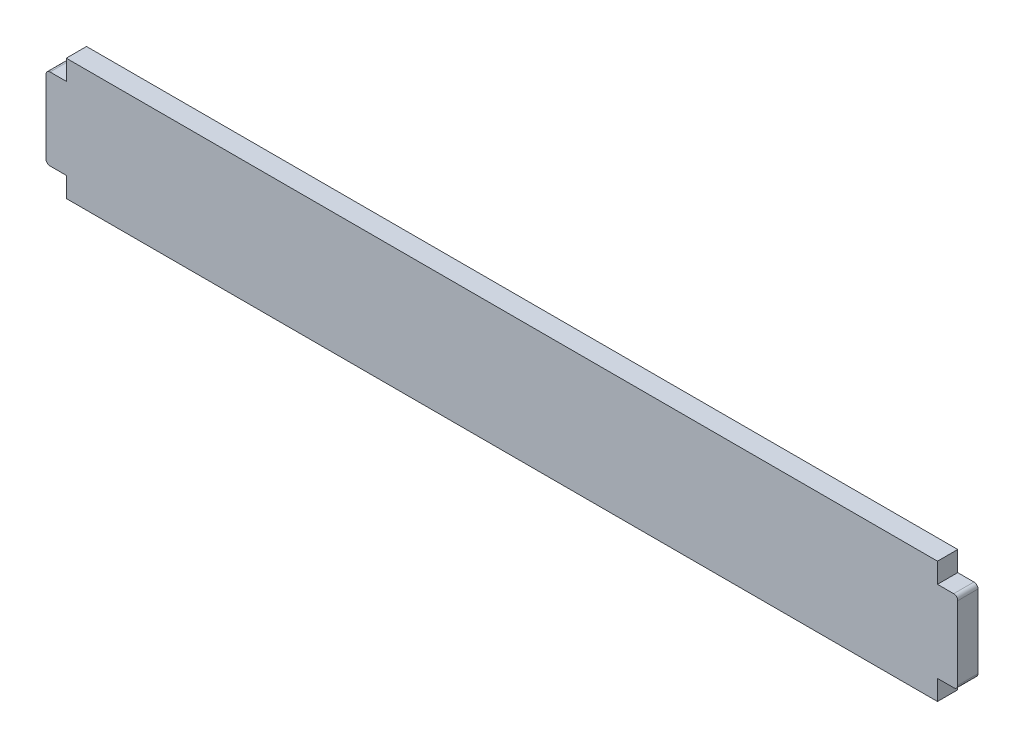
ISO-10303-21;
HEADER;
FILE_DESCRIPTION(('STEP AP214'),'2;1');
FILE_NAME('part.step','',(''),(''),'','','');
FILE_SCHEMA(('AUTOMOTIVE_DESIGN { 1 0 10303 214 1 1 1 1 }'));
ENDSEC;
DATA;
#1=APPLICATION_CONTEXT('core data for automotive mechanical design processes');
#2=APPLICATION_PROTOCOL_DEFINITION('international standard','automotive_design',2000,#1);
#3=PRODUCT_CONTEXT('',#1,'mechanical');
#4=PRODUCT('Part','Part','',(#3));
#5=PRODUCT_RELATED_PRODUCT_CATEGORY('part','',(#4));
#6=PRODUCT_DEFINITION_FORMATION('','',#4);
#7=PRODUCT_DEFINITION_CONTEXT('part definition',#1,'design');
#8=PRODUCT_DEFINITION('design','',#6,#7);
#9=PRODUCT_DEFINITION_SHAPE('','',#8);
#10=(LENGTH_UNIT() NAMED_UNIT(*) SI_UNIT(.MILLI.,.METRE.));
#11=(NAMED_UNIT(*) PLANE_ANGLE_UNIT() SI_UNIT($,.RADIAN.));
#12=(NAMED_UNIT(*) SI_UNIT($,.STERADIAN.) SOLID_ANGLE_UNIT());
#13=UNCERTAINTY_MEASURE_WITH_UNIT(LENGTH_MEASURE(1.E-05),#10,'distance_accuracy_value','');
#14=(GEOMETRIC_REPRESENTATION_CONTEXT(3) GLOBAL_UNCERTAINTY_ASSIGNED_CONTEXT((#13)) GLOBAL_UNIT_ASSIGNED_CONTEXT((#10,
#11,#12)) REPRESENTATION_CONTEXT('',''));
#15=CARTESIAN_POINT('',(0.,0.,0.));
#16=DIRECTION('',(0.,0.,1.));
#17=DIRECTION('',(1.,0.,0.));
#18=AXIS2_PLACEMENT_3D('',#15,#16,#17);
#19=CARTESIAN_POINT('',(4.99999999999999,30.05,5.));
#20=DIRECTION('',(1.,0.,0.));
#21=DIRECTION('',(0.,1.,0.));
#22=AXIS2_PLACEMENT_3D('',#19,#20,#21);
#23=PLANE('',#22);
#24=DIRECTION('',(0.,-1.,0.));
#25=VECTOR('',#24,1.);
#26=CARTESIAN_POINT('',(4.99999999999999,30.05,0.));
#27=LINE('',#26,#25);
#28=CARTESIAN_POINT('',(4.99999999999999,30.05,0.));
#29=VERTEX_POINT('',#28);
#30=CARTESIAN_POINT('',(5.,25.1,0.));
#31=VERTEX_POINT('',#30);
#32=EDGE_CURVE('E176',#29,#31,#27,.T.);
#33=ORIENTED_EDGE('',*,*,#32,.T.);
#34=DIRECTION('',(0.,0.,-1.));
#35=VECTOR('',#34,1.);
#36=CARTESIAN_POINT('',(5.,25.1,5.));
#37=LINE('',#36,#35);
#38=CARTESIAN_POINT('',(5.,25.1,5.));
#39=VERTEX_POINT('',#38);
#40=EDGE_CURVE('E158',#39,#31,#37,.T.);
#41=ORIENTED_EDGE('',*,*,#40,.F.);
#42=DIRECTION('',(0.,-1.,0.));
#43=VECTOR('',#42,1.);
#44=CARTESIAN_POINT('',(4.99999999999999,30.05,5.));
#45=LINE('',#44,#43);
#46=CARTESIAN_POINT('',(4.99999999999999,30.05,5.));
#47=VERTEX_POINT('',#46);
#48=EDGE_CURVE('E163',#47,#39,#45,.T.);
#49=ORIENTED_EDGE('',*,*,#48,.F.);
#50=DIRECTION('',(0.,0.,-1.));
#51=VECTOR('',#50,1.);
#52=CARTESIAN_POINT('',(4.99999999999999,30.05,5.));
#53=LINE('',#52,#51);
#54=EDGE_CURVE('E258',#47,#29,#53,.T.);
#55=ORIENTED_EDGE('',*,*,#54,.T.);
#56=EDGE_LOOP('',(#33,#41,#49,#55));
#57=FACE_BOUND('',#56,.T.);
#58=ADVANCED_FACE('F40',(#57),#23,.F.);
#59=CARTESIAN_POINT('',(0.,25.1,5.));
#60=DIRECTION('',(0.,-1.,0.));
#61=DIRECTION('',(0.,0.,-1.));
#62=AXIS2_PLACEMENT_3D('',#59,#60,#61);
#63=PLANE('',#62);
#64=DIRECTION('',(-1.,0.,0.));
#65=VECTOR('',#64,1.);
#66=CARTESIAN_POINT('',(0.,25.1,0.));
#67=LINE('',#66,#65);
#68=CARTESIAN_POINT('',(0.999999999999994,25.1,0.));
#69=VERTEX_POINT('',#68);
#70=EDGE_CURVE('E240',#31,#69,#67,.T.);
#71=ORIENTED_EDGE('',*,*,#70,.T.);
#72=DIRECTION('',(0.,0.,-1.));
#73=VECTOR('',#72,1.);
#74=CARTESIAN_POINT('',(0.999999999999994,25.1,5.));
#75=LINE('',#74,#73);
#76=CARTESIAN_POINT('',(0.999999999999994,25.1,5.));
#77=VERTEX_POINT('',#76);
#78=EDGE_CURVE('E11',#69,#77,#75,.F.);
#79=ORIENTED_EDGE('',*,*,#78,.T.);
#80=DIRECTION('',(-1.,0.,0.));
#81=VECTOR('',#80,1.);
#82=CARTESIAN_POINT('',(0.,25.1,5.));
#83=LINE('',#82,#81);
#84=EDGE_CURVE('E153',#39,#77,#83,.T.);
#85=ORIENTED_EDGE('',*,*,#84,.F.);
#86=ORIENTED_EDGE('',*,*,#40,.T.);
#87=EDGE_LOOP('',(#71,#79,#85,#86));
#88=FACE_BOUND('',#87,.T.);
#89=ADVANCED_FACE('F156',(#88),#63,.F.);
#90=CARTESIAN_POINT('',(0.,5.,5.));
#91=DIRECTION('',(1.,0.,0.));
#92=DIRECTION('',(0.,1.,0.));
#93=AXIS2_PLACEMENT_3D('',#90,#91,#92);
#94=PLANE('',#93);
#95=DIRECTION('',(0.,-1.,0.));
#96=VECTOR('',#95,1.);
#97=CARTESIAN_POINT('',(0.,5.,0.));
#98=LINE('',#97,#96);
#99=CARTESIAN_POINT('',(0.,24.1,0.));
#100=VERTEX_POINT('',#99);
#101=CARTESIAN_POINT('',(0.,6.,0.));
#102=VERTEX_POINT('',#101);
#103=EDGE_CURVE('E220',#100,#102,#98,.T.);
#104=ORIENTED_EDGE('',*,*,#103,.T.);
#105=DIRECTION('',(0.,0.,-1.));
#106=VECTOR('',#105,1.);
#107=CARTESIAN_POINT('',(0.,6.,5.));
#108=LINE('',#107,#106);
#109=CARTESIAN_POINT('',(0.,6.,5.));
#110=VERTEX_POINT('',#109);
#111=EDGE_CURVE('E48',#102,#110,#108,.F.);
#112=ORIENTED_EDGE('',*,*,#111,.T.);
#113=DIRECTION('',(0.,-1.,0.));
#114=VECTOR('',#113,1.);
#115=CARTESIAN_POINT('',(0.,5.,5.));
#116=LINE('',#115,#114);
#117=CARTESIAN_POINT('',(0.,24.1,5.));
#118=VERTEX_POINT('',#117);
#119=EDGE_CURVE('E162',#118,#110,#116,.T.);
#120=ORIENTED_EDGE('',*,*,#119,.F.);
#121=DIRECTION('',(0.,0.,-1.));
#122=VECTOR('',#121,1.);
#123=CARTESIAN_POINT('',(0.,24.1,5.));
#124=LINE('',#123,#122);
#125=EDGE_CURVE('E211',#118,#100,#124,.T.);
#126=ORIENTED_EDGE('',*,*,#125,.T.);
#127=EDGE_LOOP('',(#104,#112,#120,#126));
#128=FACE_BOUND('',#127,.T.);
#129=ADVANCED_FACE('F217',(#128),#94,.F.);
#130=CARTESIAN_POINT('',(0.,5.,5.));
#131=DIRECTION('',(0.,1.,0.));
#132=DIRECTION('',(0.,0.,1.));
#133=AXIS2_PLACEMENT_3D('',#130,#131,#132);
#134=PLANE('',#133);
#135=DIRECTION('',(1.,0.,0.));
#136=VECTOR('',#135,1.);
#137=CARTESIAN_POINT('',(0.,5.,5.));
#138=LINE('',#137,#136);
#139=CARTESIAN_POINT('',(1.,5.,5.));
#140=VERTEX_POINT('',#139);
#141=CARTESIAN_POINT('',(5.,5.,5.));
#142=VERTEX_POINT('',#141);
#143=EDGE_CURVE('E222',#140,#142,#138,.T.);
#144=ORIENTED_EDGE('',*,*,#143,.F.);
#145=DIRECTION('',(0.,0.,-1.));
#146=VECTOR('',#145,1.);
#147=CARTESIAN_POINT('',(1.,5.,5.));
#148=LINE('',#147,#146);
#149=CARTESIAN_POINT('',(1.,5.,0.));
#150=VERTEX_POINT('',#149);
#151=EDGE_CURVE('E208',#140,#150,#148,.T.);
#152=ORIENTED_EDGE('',*,*,#151,.T.);
#153=DIRECTION('',(1.,0.,0.));
#154=VECTOR('',#153,1.);
#155=CARTESIAN_POINT('',(0.,5.,0.));
#156=LINE('',#155,#154);
#157=CARTESIAN_POINT('',(5.,5.,0.));
#158=VERTEX_POINT('',#157);
#159=EDGE_CURVE('E230',#150,#158,#156,.T.);
#160=ORIENTED_EDGE('',*,*,#159,.T.);
#161=DIRECTION('',(0.,0.,-1.));
#162=VECTOR('',#161,1.);
#163=CARTESIAN_POINT('',(5.,5.,5.));
#164=LINE('',#163,#162);
#165=EDGE_CURVE('E178',#142,#158,#164,.T.);
#166=ORIENTED_EDGE('',*,*,#165,.F.);
#167=EDGE_LOOP('',(#144,#152,#160,#166));
#168=FACE_BOUND('',#167,.T.);
#169=ADVANCED_FACE('F228',(#168),#134,.F.);
#170=CARTESIAN_POINT('',(5.,0.0499999999999997,5.));
#171=DIRECTION('',(1.,0.,0.));
#172=DIRECTION('',(0.,1.,0.));
#173=AXIS2_PLACEMENT_3D('',#170,#171,#172);
#174=PLANE('',#173);
#175=DIRECTION('',(0.,-1.,0.));
#176=VECTOR('',#175,1.);
#177=CARTESIAN_POINT('',(5.,0.0499999999999997,0.));
#178=LINE('',#177,#176);
#179=CARTESIAN_POINT('',(5.,0.0499999999999997,0.));
#180=VERTEX_POINT('',#179);
#181=EDGE_CURVE('E236',#158,#180,#178,.T.);
#182=ORIENTED_EDGE('',*,*,#181,.T.);
#183=DIRECTION('',(0.,0.,-1.));
#184=VECTOR('',#183,1.);
#185=CARTESIAN_POINT('',(5.,0.0499999999999997,5.));
#186=LINE('',#185,#184);
#187=CARTESIAN_POINT('',(5.,0.0499999999999997,5.));
#188=VERTEX_POINT('',#187);
#189=EDGE_CURVE('E183',#188,#180,#186,.T.);
#190=ORIENTED_EDGE('',*,*,#189,.F.);
#191=DIRECTION('',(0.,-1.,0.));
#192=VECTOR('',#191,1.);
#193=CARTESIAN_POINT('',(5.,0.0499999999999997,5.));
#194=LINE('',#193,#192);
#195=EDGE_CURVE('E486',#142,#188,#194,.T.);
#196=ORIENTED_EDGE('',*,*,#195,.F.);
#197=ORIENTED_EDGE('',*,*,#165,.T.);
#198=EDGE_LOOP('',(#182,#190,#196,#197));
#199=FACE_BOUND('',#198,.T.);
#200=ADVANCED_FACE('F362',(#199),#174,.F.);
#201=CARTESIAN_POINT('',(5.,0.0499999999999997,5.));
#202=DIRECTION('',(0.,1.,0.));
#203=DIRECTION('',(-1.,0.,0.));
#204=AXIS2_PLACEMENT_3D('',#201,#202,#203);
#205=PLANE('',#204);
#206=DIRECTION('',(1.,0.,0.));
#207=VECTOR('',#206,1.);
#208=CARTESIAN_POINT('',(5.,0.0499999999999997,0.));
#209=LINE('',#208,#207);
#210=CARTESIAN_POINT('',(220.,0.0500000000000129,0.));
#211=VERTEX_POINT('',#210);
#212=EDGE_CURVE('E238',#180,#211,#209,.T.);
#213=ORIENTED_EDGE('',*,*,#212,.T.);
#214=DIRECTION('',(0.,0.,-1.));
#215=VECTOR('',#214,1.);
#216=CARTESIAN_POINT('',(220.,0.0500000000000129,5.));
#217=LINE('',#216,#215);
#218=CARTESIAN_POINT('',(220.,0.0500000000000129,5.));
#219=VERTEX_POINT('',#218);
#220=EDGE_CURVE('E269',#219,#211,#217,.T.);
#221=ORIENTED_EDGE('',*,*,#220,.F.);
#222=DIRECTION('',(1.,0.,0.));
#223=VECTOR('',#222,1.);
#224=CARTESIAN_POINT('',(5.,0.0499999999999997,5.));
#225=LINE('',#224,#223);
#226=EDGE_CURVE('E277',#188,#219,#225,.T.);
#227=ORIENTED_EDGE('',*,*,#226,.F.);
#228=ORIENTED_EDGE('',*,*,#189,.T.);
#229=EDGE_LOOP('',(#213,#221,#227,#228));
#230=FACE_BOUND('',#229,.T.);
#231=ADVANCED_FACE('F275',(#230),#205,.F.);
#232=CARTESIAN_POINT('',(220.,0.0500000000000129,5.));
#233=DIRECTION('',(-1.,0.,0.));
#234=DIRECTION('',(0.,0.,1.));
#235=AXIS2_PLACEMENT_3D('',#232,#233,#234);
#236=PLANE('',#235);
#237=DIRECTION('',(0.,1.,0.));
#238=VECTOR('',#237,1.);
#239=CARTESIAN_POINT('',(220.,0.0500000000000129,0.));
#240=LINE('',#239,#238);
#241=CARTESIAN_POINT('',(220.,5.00000000000001,0.));
#242=VERTEX_POINT('',#241);
#243=EDGE_CURVE('E245',#211,#242,#240,.T.);
#244=ORIENTED_EDGE('',*,*,#243,.T.);
#245=DIRECTION('',(0.,0.,-1.));
#246=VECTOR('',#245,1.);
#247=CARTESIAN_POINT('',(220.,5.00000000000001,5.));
#248=LINE('',#247,#246);
#249=CARTESIAN_POINT('',(220.,5.00000000000001,5.));
#250=VERTEX_POINT('',#249);
#251=EDGE_CURVE('E266',#250,#242,#248,.T.);
#252=ORIENTED_EDGE('',*,*,#251,.F.);
#253=DIRECTION('',(0.,1.,0.));
#254=VECTOR('',#253,1.);
#255=CARTESIAN_POINT('',(220.,0.0500000000000129,5.));
#256=LINE('',#255,#254);
#257=EDGE_CURVE('E293',#219,#250,#256,.T.);
#258=ORIENTED_EDGE('',*,*,#257,.F.);
#259=ORIENTED_EDGE('',*,*,#220,.T.);
#260=EDGE_LOOP('',(#244,#252,#258,#259));
#261=FACE_BOUND('',#260,.T.);
#262=ADVANCED_FACE('F284',(#261),#236,.F.);
#263=CARTESIAN_POINT('',(225.,5.00000000000001,5.));
#264=DIRECTION('',(0.,1.,0.));
#265=DIRECTION('',(-1.,0.,0.));
#266=AXIS2_PLACEMENT_3D('',#263,#264,#265);
#267=PLANE('',#266);
#268=DIRECTION('',(1.,0.,0.));
#269=VECTOR('',#268,1.);
#270=CARTESIAN_POINT('',(225.,5.00000000000001,0.));
#271=LINE('',#270,#269);
#272=CARTESIAN_POINT('',(224.,5.00000000000001,0.));
#273=VERTEX_POINT('',#272);
#274=EDGE_CURVE('E247',#242,#273,#271,.T.);
#275=ORIENTED_EDGE('',*,*,#274,.T.);
#276=DIRECTION('',(0.,0.,-1.));
#277=VECTOR('',#276,1.);
#278=CARTESIAN_POINT('',(224.,5.00000000000001,5.));
#279=LINE('',#278,#277);
#280=CARTESIAN_POINT('',(224.,5.00000000000001,5.));
#281=VERTEX_POINT('',#280);
#282=EDGE_CURVE('E197',#273,#281,#279,.F.);
#283=ORIENTED_EDGE('',*,*,#282,.T.);
#284=DIRECTION('',(1.,0.,0.));
#285=VECTOR('',#284,1.);
#286=CARTESIAN_POINT('',(225.,5.00000000000001,5.));
#287=LINE('',#286,#285);
#288=EDGE_CURVE('E290',#250,#281,#287,.T.);
#289=ORIENTED_EDGE('',*,*,#288,.F.);
#290=ORIENTED_EDGE('',*,*,#251,.T.);
#291=EDGE_LOOP('',(#275,#283,#289,#290));
#292=FACE_BOUND('',#291,.T.);
#293=ADVANCED_FACE('F288',(#292),#267,.F.);
#294=CARTESIAN_POINT('',(225.,5.00000000000001,5.));
#295=DIRECTION('',(-1.,0.,0.));
#296=DIRECTION('',(0.,0.,1.));
#297=AXIS2_PLACEMENT_3D('',#294,#295,#296);
#298=PLANE('',#297);
#299=DIRECTION('',(0.,1.,0.));
#300=VECTOR('',#299,1.);
#301=CARTESIAN_POINT('',(225.,5.00000000000001,5.));
#302=LINE('',#301,#300);
#303=CARTESIAN_POINT('',(225.,6.00000000000001,5.));
#304=VERTEX_POINT('',#303);
#305=CARTESIAN_POINT('',(225.,24.1,5.));
#306=VERTEX_POINT('',#305);
#307=EDGE_CURVE('E292',#304,#306,#302,.T.);
#308=ORIENTED_EDGE('',*,*,#307,.F.);
#309=DIRECTION('',(0.,0.,-1.));
#310=VECTOR('',#309,1.);
#311=CARTESIAN_POINT('',(225.,6.00000000000001,5.));
#312=LINE('',#311,#310);
#313=CARTESIAN_POINT('',(225.,6.00000000000001,0.));
#314=VERTEX_POINT('',#313);
#315=EDGE_CURVE('E180',#304,#314,#312,.T.);
#316=ORIENTED_EDGE('',*,*,#315,.T.);
#317=DIRECTION('',(0.,1.,0.));
#318=VECTOR('',#317,1.);
#319=CARTESIAN_POINT('',(225.,5.00000000000001,0.));
#320=LINE('',#319,#318);
#321=CARTESIAN_POINT('',(225.,24.1,0.));
#322=VERTEX_POINT('',#321);
#323=EDGE_CURVE('E250',#314,#322,#320,.T.);
#324=ORIENTED_EDGE('',*,*,#323,.T.);
#325=DIRECTION('',(0.,0.,-1.));
#326=VECTOR('',#325,1.);
#327=CARTESIAN_POINT('',(225.,24.1,5.));
#328=LINE('',#327,#326);
#329=EDGE_CURVE('E177',#322,#306,#328,.F.);
#330=ORIENTED_EDGE('',*,*,#329,.T.);
#331=EDGE_LOOP('',(#308,#316,#324,#330));
#332=FACE_BOUND('',#331,.T.);
#333=ADVANCED_FACE('F352',(#332),#298,.F.);
#334=CARTESIAN_POINT('',(225.,25.1,5.));
#335=DIRECTION('',(0.,-1.,0.));
#336=DIRECTION('',(0.,0.,-1.));
#337=AXIS2_PLACEMENT_3D('',#334,#335,#336);
#338=PLANE('',#337);
#339=DIRECTION('',(-1.,0.,0.));
#340=VECTOR('',#339,1.);
#341=CARTESIAN_POINT('',(225.,25.1,5.));
#342=LINE('',#341,#340);
#343=CARTESIAN_POINT('',(224.,25.1,5.));
#344=VERTEX_POINT('',#343);
#345=CARTESIAN_POINT('',(220.,25.1,5.));
#346=VERTEX_POINT('',#345);
#347=EDGE_CURVE('E295',#344,#346,#342,.T.);
#348=ORIENTED_EDGE('',*,*,#347,.F.);
#349=DIRECTION('',(0.,0.,-1.));
#350=VECTOR('',#349,1.);
#351=CARTESIAN_POINT('',(224.,25.1,5.));
#352=LINE('',#351,#350);
#353=CARTESIAN_POINT('',(224.,25.1,0.));
#354=VERTEX_POINT('',#353);
#355=EDGE_CURVE('E205',#344,#354,#352,.T.);
#356=ORIENTED_EDGE('',*,*,#355,.T.);
#357=DIRECTION('',(-1.,0.,0.));
#358=VECTOR('',#357,1.);
#359=CARTESIAN_POINT('',(225.,25.1,0.));
#360=LINE('',#359,#358);
#361=CARTESIAN_POINT('',(220.,25.1,0.));
#362=VERTEX_POINT('',#361);
#363=EDGE_CURVE('E253',#354,#362,#360,.T.);
#364=ORIENTED_EDGE('',*,*,#363,.T.);
#365=DIRECTION('',(0.,0.,-1.));
#366=VECTOR('',#365,1.);
#367=CARTESIAN_POINT('',(220.,25.1,5.));
#368=LINE('',#367,#366);
#369=EDGE_CURVE('E263',#346,#362,#368,.T.);
#370=ORIENTED_EDGE('',*,*,#369,.F.);
#371=EDGE_LOOP('',(#348,#356,#364,#370));
#372=FACE_BOUND('',#371,.T.);
#373=ADVANCED_FACE('F330',(#372),#338,.F.);
#374=CARTESIAN_POINT('',(220.,30.05,5.));
#375=DIRECTION('',(-1.,0.,0.));
#376=DIRECTION('',(0.,0.,1.));
#377=AXIS2_PLACEMENT_3D('',#374,#375,#376);
#378=PLANE('',#377);
#379=DIRECTION('',(0.,1.,0.));
#380=VECTOR('',#379,1.);
#381=CARTESIAN_POINT('',(220.,30.05,0.));
#382=LINE('',#381,#380);
#383=CARTESIAN_POINT('',(220.,30.05,0.));
#384=VERTEX_POINT('',#383);
#385=EDGE_CURVE('E255',#362,#384,#382,.T.);
#386=ORIENTED_EDGE('',*,*,#385,.T.);
#387=DIRECTION('',(0.,0.,-1.));
#388=VECTOR('',#387,1.);
#389=CARTESIAN_POINT('',(220.,30.05,5.));
#390=LINE('',#389,#388);
#391=CARTESIAN_POINT('',(220.,30.05,5.));
#392=VERTEX_POINT('',#391);
#393=EDGE_CURVE('E260',#392,#384,#390,.T.);
#394=ORIENTED_EDGE('',*,*,#393,.F.);
#395=DIRECTION('',(0.,1.,0.));
#396=VECTOR('',#395,1.);
#397=CARTESIAN_POINT('',(220.,30.05,5.));
#398=LINE('',#397,#396);
#399=EDGE_CURVE('E301',#346,#392,#398,.T.);
#400=ORIENTED_EDGE('',*,*,#399,.F.);
#401=ORIENTED_EDGE('',*,*,#369,.T.);
#402=EDGE_LOOP('',(#386,#394,#400,#401));
#403=FACE_BOUND('',#402,.T.);
#404=ADVANCED_FACE('F336',(#403),#378,.F.);
#405=CARTESIAN_POINT('',(4.99999999999999,30.05,5.));
#406=DIRECTION('',(0.,-1.,0.));
#407=DIRECTION('',(1.,0.,0.));
#408=AXIS2_PLACEMENT_3D('',#405,#406,#407);
#409=PLANE('',#408);
#410=DIRECTION('',(-1.,0.,0.));
#411=VECTOR('',#410,1.);
#412=CARTESIAN_POINT('',(4.99999999999999,30.05,0.));
#413=LINE('',#412,#411);
#414=EDGE_CURVE('E173',#384,#29,#413,.T.);
#415=ORIENTED_EDGE('',*,*,#414,.T.);
#416=ORIENTED_EDGE('',*,*,#54,.F.);
#417=DIRECTION('',(-1.,0.,0.));
#418=VECTOR('',#417,1.);
#419=CARTESIAN_POINT('',(4.99999999999999,30.05,5.));
#420=LINE('',#419,#418);
#421=EDGE_CURVE('E169',#392,#47,#420,.T.);
#422=ORIENTED_EDGE('',*,*,#421,.F.);
#423=ORIENTED_EDGE('',*,*,#393,.T.);
#424=EDGE_LOOP('',(#415,#416,#422,#423));
#425=FACE_BOUND('',#424,.T.);
#426=ADVANCED_FACE('F339',(#425),#409,.F.);
#427=CARTESIAN_POINT('',(0.,0.,5.));
#428=DIRECTION('',(0.,0.,1.));
#429=DIRECTION('',(1.,0.,0.));
#430=AXIS2_PLACEMENT_3D('',#427,#428,#429);
#431=PLANE('',#430);
#432=ORIENTED_EDGE('',*,*,#288,.T.);
#433=CARTESIAN_POINT('',(224.,6.00000000000001,5.));
#434=DIRECTION('',(0.,0.,1.));
#435=DIRECTION('',(1.,0.,0.));
#436=AXIS2_PLACEMENT_3D('',#433,#434,#435);
#437=CIRCLE('',#436,1.);
#438=EDGE_CURVE('E203',#281,#304,#437,.T.);
#439=ORIENTED_EDGE('',*,*,#438,.T.);
#440=ORIENTED_EDGE('',*,*,#307,.T.);
#441=CARTESIAN_POINT('',(224.,24.1,5.));
#442=DIRECTION('',(0.,0.,1.));
#443=DIRECTION('',(1.,0.,0.));
#444=AXIS2_PLACEMENT_3D('',#441,#442,#443);
#445=CIRCLE('',#444,1.);
#446=EDGE_CURVE('E55',#306,#344,#445,.T.);
#447=ORIENTED_EDGE('',*,*,#446,.T.);
#448=ORIENTED_EDGE('',*,*,#347,.T.);
#449=ORIENTED_EDGE('',*,*,#399,.T.);
#450=ORIENTED_EDGE('',*,*,#421,.T.);
#451=ORIENTED_EDGE('',*,*,#48,.T.);
#452=ORIENTED_EDGE('',*,*,#84,.T.);
#453=CARTESIAN_POINT('',(0.999999999999994,24.1,5.));
#454=DIRECTION('',(0.,0.,1.));
#455=DIRECTION('',(1.,0.,0.));
#456=AXIS2_PLACEMENT_3D('',#453,#454,#455);
#457=CIRCLE('',#456,1.);
#458=EDGE_CURVE('E199',#77,#118,#457,.T.);
#459=ORIENTED_EDGE('',*,*,#458,.T.);
#460=ORIENTED_EDGE('',*,*,#119,.T.);
#461=CARTESIAN_POINT('',(1.,6.,5.));
#462=DIRECTION('',(0.,0.,1.));
#463=DIRECTION('',(1.,0.,0.));
#464=AXIS2_PLACEMENT_3D('',#461,#462,#463);
#465=CIRCLE('',#464,1.);
#466=EDGE_CURVE('E62',#110,#140,#465,.T.);
#467=ORIENTED_EDGE('',*,*,#466,.T.);
#468=ORIENTED_EDGE('',*,*,#143,.T.);
#469=ORIENTED_EDGE('',*,*,#195,.T.);
#470=ORIENTED_EDGE('',*,*,#226,.T.);
#471=ORIENTED_EDGE('',*,*,#257,.T.);
#472=EDGE_LOOP('',(#432,#439,#440,#447,#448,#449,#450,#451,#452,#459,#460,#467,#468,#469,#470,#471));
#473=FACE_BOUND('',#472,.T.);
#474=ADVANCED_FACE('F167',(#473),#431,.T.);
#475=CARTESIAN_POINT('',(0.,0.,0.));
#476=DIRECTION('',(0.,0.,1.));
#477=DIRECTION('',(1.,0.,0.));
#478=AXIS2_PLACEMENT_3D('',#475,#476,#477);
#479=PLANE('',#478);
#480=ORIENTED_EDGE('',*,*,#323,.F.);
#481=CARTESIAN_POINT('',(224.,6.00000000000001,0.));
#482=DIRECTION('',(0.,0.,1.));
#483=DIRECTION('',(1.,0.,0.));
#484=AXIS2_PLACEMENT_3D('',#481,#482,#483);
#485=CIRCLE('',#484,1.);
#486=EDGE_CURVE('E195',#314,#273,#485,.F.);
#487=ORIENTED_EDGE('',*,*,#486,.T.);
#488=ORIENTED_EDGE('',*,*,#274,.F.);
#489=ORIENTED_EDGE('',*,*,#243,.F.);
#490=ORIENTED_EDGE('',*,*,#212,.F.);
#491=ORIENTED_EDGE('',*,*,#181,.F.);
#492=ORIENTED_EDGE('',*,*,#159,.F.);
#493=CARTESIAN_POINT('',(1.,6.,0.));
#494=DIRECTION('',(0.,0.,1.));
#495=DIRECTION('',(1.,0.,0.));
#496=AXIS2_PLACEMENT_3D('',#493,#494,#495);
#497=CIRCLE('',#496,1.);
#498=EDGE_CURVE('E191',#150,#102,#497,.F.);
#499=ORIENTED_EDGE('',*,*,#498,.T.);
#500=ORIENTED_EDGE('',*,*,#103,.F.);
#501=CARTESIAN_POINT('',(0.999999999999994,24.1,0.));
#502=DIRECTION('',(0.,0.,1.));
#503=DIRECTION('',(1.,0.,0.));
#504=AXIS2_PLACEMENT_3D('',#501,#502,#503);
#505=CIRCLE('',#504,1.);
#506=EDGE_CURVE('E189',#100,#69,#505,.F.);
#507=ORIENTED_EDGE('',*,*,#506,.T.);
#508=ORIENTED_EDGE('',*,*,#70,.F.);
#509=ORIENTED_EDGE('',*,*,#32,.F.);
#510=ORIENTED_EDGE('',*,*,#414,.F.);
#511=ORIENTED_EDGE('',*,*,#385,.F.);
#512=ORIENTED_EDGE('',*,*,#363,.F.);
#513=CARTESIAN_POINT('',(224.,24.1,0.));
#514=DIRECTION('',(0.,0.,1.));
#515=DIRECTION('',(1.,0.,0.));
#516=AXIS2_PLACEMENT_3D('',#513,#514,#515);
#517=CIRCLE('',#516,1.);
#518=EDGE_CURVE('E193',#354,#322,#517,.F.);
#519=ORIENTED_EDGE('',*,*,#518,.T.);
#520=EDGE_LOOP('',(#480,#487,#488,#489,#490,#491,#492,#499,#500,#507,#508,#509,#510,#511,#512,#519));
#521=FACE_BOUND('',#520,.T.);
#522=ADVANCED_FACE('F234',(#521),#479,.F.);
#523=CARTESIAN_POINT('',(224.,6.00000000000001,5.));
#524=DIRECTION('',(0.,0.,-1.));
#525=DIRECTION('',(-1.,0.,0.));
#526=AXIS2_PLACEMENT_3D('',#523,#524,#525);
#527=CYLINDRICAL_SURFACE('',#526,1.);
#528=ORIENTED_EDGE('',*,*,#438,.F.);
#529=ORIENTED_EDGE('',*,*,#282,.F.);
#530=ORIENTED_EDGE('',*,*,#486,.F.);
#531=ORIENTED_EDGE('',*,*,#315,.F.);
#532=EDGE_LOOP('',(#528,#529,#530,#531));
#533=FACE_BOUND('',#532,.T.);
#534=ADVANCED_FACE('F318',(#533),#527,.T.);
#535=CARTESIAN_POINT('',(224.,24.1,5.));
#536=DIRECTION('',(0.,0.,-1.));
#537=DIRECTION('',(-1.,0.,0.));
#538=AXIS2_PLACEMENT_3D('',#535,#536,#537);
#539=CYLINDRICAL_SURFACE('',#538,1.);
#540=ORIENTED_EDGE('',*,*,#446,.F.);
#541=ORIENTED_EDGE('',*,*,#329,.F.);
#542=ORIENTED_EDGE('',*,*,#518,.F.);
#543=ORIENTED_EDGE('',*,*,#355,.F.);
#544=EDGE_LOOP('',(#540,#541,#542,#543));
#545=FACE_BOUND('',#544,.T.);
#546=ADVANCED_FACE('F309',(#545),#539,.T.);
#547=CARTESIAN_POINT('',(1.,6.,5.));
#548=DIRECTION('',(0.,0.,-1.));
#549=DIRECTION('',(-1.,0.,0.));
#550=AXIS2_PLACEMENT_3D('',#547,#548,#549);
#551=CYLINDRICAL_SURFACE('',#550,1.);
#552=ORIENTED_EDGE('',*,*,#466,.F.);
#553=ORIENTED_EDGE('',*,*,#111,.F.);
#554=ORIENTED_EDGE('',*,*,#498,.F.);
#555=ORIENTED_EDGE('',*,*,#151,.F.);
#556=EDGE_LOOP('',(#552,#553,#554,#555));
#557=FACE_BOUND('',#556,.T.);
#558=ADVANCED_FACE('F225',(#557),#551,.T.);
#559=CARTESIAN_POINT('',(0.999999999999994,24.1,5.));
#560=DIRECTION('',(0.,0.,-1.));
#561=DIRECTION('',(-1.,0.,0.));
#562=AXIS2_PLACEMENT_3D('',#559,#560,#561);
#563=CYLINDRICAL_SURFACE('',#562,1.);
#564=ORIENTED_EDGE('',*,*,#458,.F.);
#565=ORIENTED_EDGE('',*,*,#78,.F.);
#566=ORIENTED_EDGE('',*,*,#506,.F.);
#567=ORIENTED_EDGE('',*,*,#125,.F.);
#568=EDGE_LOOP('',(#564,#565,#566,#567));
#569=FACE_BOUND('',#568,.T.);
#570=ADVANCED_FACE('F42',(#569),#563,.T.);
#571=CLOSED_SHELL('',(#58,#89,#129,#169,#200,#231,#262,#293,#333,#373,#404,#426,#474,#522,#534,
#546,#558,#570));
#572=MANIFOLD_SOLID_BREP('B2',#571);
#573=ADVANCED_BREP_SHAPE_REPRESENTATION('',(#18,#572),#14);
#574=SHAPE_DEFINITION_REPRESENTATION(#9,#573);
ENDSEC;
END-ISO-10303-21;
